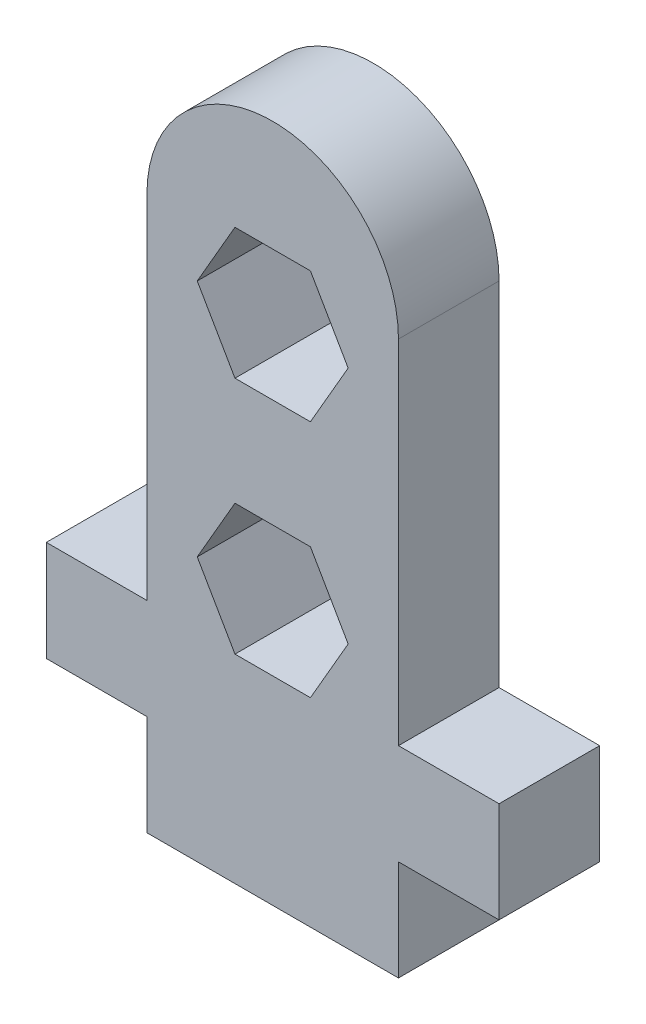
ISO-10303-21;
HEADER;
FILE_DESCRIPTION(('STEP AP214'),'2;1');
FILE_NAME('part.step','',(''),(''),'','','');
FILE_SCHEMA(('AUTOMOTIVE_DESIGN { 1 0 10303 214 1 1 1 1 }'));
ENDSEC;
DATA;
#1=APPLICATION_CONTEXT('core data for automotive mechanical design processes');
#2=APPLICATION_PROTOCOL_DEFINITION('international standard','automotive_design',2000,#1);
#3=PRODUCT_CONTEXT('',#1,'mechanical');
#4=PRODUCT('Part','Part','',(#3));
#5=PRODUCT_RELATED_PRODUCT_CATEGORY('part','',(#4));
#6=PRODUCT_DEFINITION_FORMATION('','',#4);
#7=PRODUCT_DEFINITION_CONTEXT('part definition',#1,'design');
#8=PRODUCT_DEFINITION('design','',#6,#7);
#9=PRODUCT_DEFINITION_SHAPE('','',#8);
#10=(LENGTH_UNIT() NAMED_UNIT(*) SI_UNIT(.MILLI.,.METRE.));
#11=(NAMED_UNIT(*) PLANE_ANGLE_UNIT() SI_UNIT($,.RADIAN.));
#12=(NAMED_UNIT(*) SI_UNIT($,.STERADIAN.) SOLID_ANGLE_UNIT());
#13=UNCERTAINTY_MEASURE_WITH_UNIT(LENGTH_MEASURE(1.E-05),#10,'distance_accuracy_value','');
#14=(GEOMETRIC_REPRESENTATION_CONTEXT(3) GLOBAL_UNCERTAINTY_ASSIGNED_CONTEXT((#13)) GLOBAL_UNIT_ASSIGNED_CONTEXT((#10,
#11,#12)) REPRESENTATION_CONTEXT('',''));
#15=CARTESIAN_POINT('',(0.,0.,0.));
#16=DIRECTION('',(0.,0.,1.));
#17=DIRECTION('',(1.,0.,0.));
#18=AXIS2_PLACEMENT_3D('',#15,#16,#17);
#19=CARTESIAN_POINT('',(5.,22.,4.));
#20=DIRECTION('',(0.,0.,1.));
#21=DIRECTION('',(1.,0.,0.));
#22=AXIS2_PLACEMENT_3D('',#19,#20,#21);
#23=PLANE('',#22);
#24=DIRECTION('',(-0.5,-0.866025403784438,0.));
#25=VECTOR('',#24,1.);
#26=CARTESIAN_POINT('',(3.5,22.5980762113533,4.));
#27=LINE('',#26,#25);
#28=CARTESIAN_POINT('',(3.5,22.5980762113533,4.));
#29=VERTEX_POINT('',#28);
#30=CARTESIAN_POINT('',(1.99999999999999,20.,4.));
#31=VERTEX_POINT('',#30);
#32=EDGE_CURVE('E247',#29,#31,#27,.T.);
#33=ORIENTED_EDGE('',*,*,#32,.F.);
#34=DIRECTION('',(-1.,0.,0.));
#35=VECTOR('',#34,1.);
#36=CARTESIAN_POINT('',(6.5,22.5980762113533,4.));
#37=LINE('',#36,#35);
#38=CARTESIAN_POINT('',(6.5,22.5980762113533,4.));
#39=VERTEX_POINT('',#38);
#40=EDGE_CURVE('E245',#39,#29,#37,.T.);
#41=ORIENTED_EDGE('',*,*,#40,.F.);
#42=DIRECTION('',(-0.5,0.866025403784438,0.));
#43=VECTOR('',#42,1.);
#44=CARTESIAN_POINT('',(8.00000000000001,20.,4.));
#45=LINE('',#44,#43);
#46=CARTESIAN_POINT('',(8.00000000000001,20.,4.));
#47=VERTEX_POINT('',#46);
#48=EDGE_CURVE('E257',#47,#39,#45,.T.);
#49=ORIENTED_EDGE('',*,*,#48,.F.);
#50=DIRECTION('',(0.499999999999999,0.866025403784439,0.));
#51=VECTOR('',#50,1.);
#52=CARTESIAN_POINT('',(6.50000000000001,17.4019237886467,4.));
#53=LINE('',#52,#51);
#54=CARTESIAN_POINT('',(6.50000000000001,17.4019237886467,4.));
#55=VERTEX_POINT('',#54);
#56=EDGE_CURVE('E254',#55,#47,#53,.T.);
#57=ORIENTED_EDGE('',*,*,#56,.F.);
#58=DIRECTION('',(1.,0.,0.));
#59=VECTOR('',#58,1.);
#60=CARTESIAN_POINT('',(3.5,17.4019237886467,4.));
#61=LINE('',#60,#59);
#62=CARTESIAN_POINT('',(3.5,17.4019237886467,4.));
#63=VERTEX_POINT('',#62);
#64=EDGE_CURVE('E252',#63,#55,#61,.T.);
#65=ORIENTED_EDGE('',*,*,#64,.F.);
#66=DIRECTION('',(0.5,-0.866025403784439,0.));
#67=VECTOR('',#66,1.);
#68=CARTESIAN_POINT('',(1.99999999999999,20.,4.));
#69=LINE('',#68,#67);
#70=EDGE_CURVE('E250',#31,#63,#69,.T.);
#71=ORIENTED_EDGE('',*,*,#70,.F.);
#72=EDGE_LOOP('',(#33,#41,#49,#57,#65,#71));
#73=FACE_BOUND('',#72,.T.);
#74=DIRECTION('',(0.,-1.,0.));
#75=VECTOR('',#74,1.);
#76=CARTESIAN_POINT('',(0.,0.,4.));
#77=LINE('',#76,#75);
#78=CARTESIAN_POINT('',(0.,4.,4.));
#79=VERTEX_POINT('',#78);
#80=CARTESIAN_POINT('',(0.,0.,4.));
#81=VERTEX_POINT('',#80);
#82=EDGE_CURVE('E290',#79,#81,#77,.T.);
#83=ORIENTED_EDGE('',*,*,#82,.T.);
#84=DIRECTION('',(1.,0.,0.));
#85=VECTOR('',#84,1.);
#86=CARTESIAN_POINT('',(0.,0.,4.));
#87=LINE('',#86,#85);
#88=CARTESIAN_POINT('',(10.,0.,4.));
#89=VERTEX_POINT('',#88);
#90=EDGE_CURVE('E293',#81,#89,#87,.T.);
#91=ORIENTED_EDGE('',*,*,#90,.T.);
#92=DIRECTION('',(0.,1.,0.));
#93=VECTOR('',#92,1.);
#94=CARTESIAN_POINT('',(10.,0.,4.));
#95=LINE('',#94,#93);
#96=CARTESIAN_POINT('',(10.,4.,4.));
#97=VERTEX_POINT('',#96);
#98=EDGE_CURVE('E296',#89,#97,#95,.T.);
#99=ORIENTED_EDGE('',*,*,#98,.T.);
#100=DIRECTION('',(1.,0.,0.));
#101=VECTOR('',#100,1.);
#102=CARTESIAN_POINT('',(10.,4.,4.));
#103=LINE('',#102,#101);
#104=CARTESIAN_POINT('',(14.,4.,4.));
#105=VERTEX_POINT('',#104);
#106=EDGE_CURVE('E298',#97,#105,#103,.T.);
#107=ORIENTED_EDGE('',*,*,#106,.T.);
#108=DIRECTION('',(0.,1.,0.));
#109=VECTOR('',#108,1.);
#110=CARTESIAN_POINT('',(14.,4.,4.));
#111=LINE('',#110,#109);
#112=CARTESIAN_POINT('',(14.,8.,4.));
#113=VERTEX_POINT('',#112);
#114=EDGE_CURVE('E300',#105,#113,#111,.T.);
#115=ORIENTED_EDGE('',*,*,#114,.T.);
#116=DIRECTION('',(-1.,0.,0.));
#117=VECTOR('',#116,1.);
#118=CARTESIAN_POINT('',(14.,8.,4.));
#119=LINE('',#118,#117);
#120=CARTESIAN_POINT('',(10.,8.,4.));
#121=VERTEX_POINT('',#120);
#122=EDGE_CURVE('E302',#113,#121,#119,.T.);
#123=ORIENTED_EDGE('',*,*,#122,.T.);
#124=DIRECTION('',(0.,1.,0.));
#125=VECTOR('',#124,1.);
#126=CARTESIAN_POINT('',(10.,8.,4.));
#127=LINE('',#126,#125);
#128=CARTESIAN_POINT('',(10.,22.,4.));
#129=VERTEX_POINT('',#128);
#130=EDGE_CURVE('E304',#121,#129,#127,.T.);
#131=ORIENTED_EDGE('',*,*,#130,.T.);
#132=CARTESIAN_POINT('',(5.,22.,4.));
#133=DIRECTION('',(0.,0.,1.));
#134=DIRECTION('',(1.,0.,0.));
#135=AXIS2_PLACEMENT_3D('',#132,#133,#134);
#136=CIRCLE('',#135,5.);
#137=CARTESIAN_POINT('',(0.,22.,4.));
#138=VERTEX_POINT('',#137);
#139=EDGE_CURVE('E306',#129,#138,#136,.T.);
#140=ORIENTED_EDGE('',*,*,#139,.T.);
#141=DIRECTION('',(0.,-1.,0.));
#142=VECTOR('',#141,1.);
#143=CARTESIAN_POINT('',(0.,8.,4.));
#144=LINE('',#143,#142);
#145=CARTESIAN_POINT('',(0.,8.,4.));
#146=VERTEX_POINT('',#145);
#147=EDGE_CURVE('E308',#138,#146,#144,.T.);
#148=ORIENTED_EDGE('',*,*,#147,.T.);
#149=DIRECTION('',(-1.,0.,0.));
#150=VECTOR('',#149,1.);
#151=CARTESIAN_POINT('',(-4.,8.,4.));
#152=LINE('',#151,#150);
#153=CARTESIAN_POINT('',(-4.,8.,4.));
#154=VERTEX_POINT('',#153);
#155=EDGE_CURVE('E310',#146,#154,#152,.T.);
#156=ORIENTED_EDGE('',*,*,#155,.T.);
#157=DIRECTION('',(0.,-1.,0.));
#158=VECTOR('',#157,1.);
#159=CARTESIAN_POINT('',(-4.,4.,4.));
#160=LINE('',#159,#158);
#161=CARTESIAN_POINT('',(-4.,4.,4.));
#162=VERTEX_POINT('',#161);
#163=EDGE_CURVE('E312',#154,#162,#160,.T.);
#164=ORIENTED_EDGE('',*,*,#163,.T.);
#165=DIRECTION('',(1.,0.,0.));
#166=VECTOR('',#165,1.);
#167=CARTESIAN_POINT('',(0.,4.,4.));
#168=LINE('',#167,#166);
#169=EDGE_CURVE('E314',#162,#79,#168,.T.);
#170=ORIENTED_EDGE('',*,*,#169,.T.);
#171=EDGE_LOOP('',(#83,#91,#99,#107,#115,#123,#131,#140,#148,#156,#164,#170));
#172=FACE_BOUND('',#171,.T.);
#173=DIRECTION('',(-0.5,-0.866025403784438,0.));
#174=VECTOR('',#173,1.);
#175=CARTESIAN_POINT('',(3.5,13.0980762113533,4.));
#176=LINE('',#175,#174);
#177=CARTESIAN_POINT('',(3.5,13.0980762113533,4.));
#178=VERTEX_POINT('',#177);
#179=CARTESIAN_POINT('',(1.99999999999999,10.5,4.));
#180=VERTEX_POINT('',#179);
#181=EDGE_CURVE('E202',#178,#180,#176,.T.);
#182=ORIENTED_EDGE('',*,*,#181,.F.);
#183=DIRECTION('',(-1.,0.,0.));
#184=VECTOR('',#183,1.);
#185=CARTESIAN_POINT('',(6.5,13.0980762113533,4.));
#186=LINE('',#185,#184);
#187=CARTESIAN_POINT('',(6.5,13.0980762113533,4.));
#188=VERTEX_POINT('',#187);
#189=EDGE_CURVE('E194',#188,#178,#186,.T.);
#190=ORIENTED_EDGE('',*,*,#189,.F.);
#191=DIRECTION('',(-0.5,0.866025403784439,0.));
#192=VECTOR('',#191,1.);
#193=CARTESIAN_POINT('',(8.00000000000001,10.5,4.));
#194=LINE('',#193,#192);
#195=CARTESIAN_POINT('',(8.00000000000001,10.5,4.));
#196=VERTEX_POINT('',#195);
#197=EDGE_CURVE('E223',#196,#188,#194,.T.);
#198=ORIENTED_EDGE('',*,*,#197,.F.);
#199=DIRECTION('',(0.5,0.866025403784439,0.));
#200=VECTOR('',#199,1.);
#201=CARTESIAN_POINT('',(6.5,7.90192378864668,4.));
#202=LINE('',#201,#200);
#203=CARTESIAN_POINT('',(6.5,7.90192378864668,4.));
#204=VERTEX_POINT('',#203);
#205=EDGE_CURVE('E221',#204,#196,#202,.T.);
#206=ORIENTED_EDGE('',*,*,#205,.F.);
#207=DIRECTION('',(1.,0.,0.));
#208=VECTOR('',#207,1.);
#209=CARTESIAN_POINT('',(3.5,7.90192378864668,4.));
#210=LINE('',#209,#208);
#211=CARTESIAN_POINT('',(3.5,7.90192378864668,4.));
#212=VERTEX_POINT('',#211);
#213=EDGE_CURVE('E217',#212,#204,#210,.T.);
#214=ORIENTED_EDGE('',*,*,#213,.F.);
#215=DIRECTION('',(0.5,-0.866025403784439,0.));
#216=VECTOR('',#215,1.);
#217=CARTESIAN_POINT('',(1.99999999999999,10.5,4.));
#218=LINE('',#217,#216);
#219=EDGE_CURVE('E215',#180,#212,#218,.T.);
#220=ORIENTED_EDGE('',*,*,#219,.F.);
#221=EDGE_LOOP('',(#182,#190,#198,#206,#214,#220));
#222=FACE_BOUND('',#221,.T.);
#223=ADVANCED_FACE('F33',(#73,#172,#222),#23,.T.);
#224=CARTESIAN_POINT('',(5.,22.,0.));
#225=DIRECTION('',(0.,0.,1.));
#226=DIRECTION('',(1.,0.,0.));
#227=AXIS2_PLACEMENT_3D('',#224,#225,#226);
#228=PLANE('',#227);
#229=DIRECTION('',(-1.,0.,0.));
#230=VECTOR('',#229,1.);
#231=CARTESIAN_POINT('',(6.5,22.5980762113533,0.));
#232=LINE('',#231,#230);
#233=CARTESIAN_POINT('',(6.5,22.5980762113533,0.));
#234=VERTEX_POINT('',#233);
#235=CARTESIAN_POINT('',(3.5,22.5980762113533,0.));
#236=VERTEX_POINT('',#235);
#237=EDGE_CURVE('E210',#234,#236,#232,.T.);
#238=ORIENTED_EDGE('',*,*,#237,.T.);
#239=DIRECTION('',(-0.5,-0.866025403784438,0.));
#240=VECTOR('',#239,1.);
#241=CARTESIAN_POINT('',(3.5,22.5980762113533,0.));
#242=LINE('',#241,#240);
#243=CARTESIAN_POINT('',(1.99999999999999,20.,0.));
#244=VERTEX_POINT('',#243);
#245=EDGE_CURVE('E262',#236,#244,#242,.T.);
#246=ORIENTED_EDGE('',*,*,#245,.T.);
#247=DIRECTION('',(0.5,-0.866025403784439,0.));
#248=VECTOR('',#247,1.);
#249=CARTESIAN_POINT('',(1.99999999999999,20.,0.));
#250=LINE('',#249,#248);
#251=CARTESIAN_POINT('',(3.5,17.4019237886467,0.));
#252=VERTEX_POINT('',#251);
#253=EDGE_CURVE('E265',#244,#252,#250,.T.);
#254=ORIENTED_EDGE('',*,*,#253,.T.);
#255=DIRECTION('',(1.,0.,0.));
#256=VECTOR('',#255,1.);
#257=CARTESIAN_POINT('',(3.5,17.4019237886467,0.));
#258=LINE('',#257,#256);
#259=CARTESIAN_POINT('',(6.50000000000001,17.4019237886467,0.));
#260=VERTEX_POINT('',#259);
#261=EDGE_CURVE('E268',#252,#260,#258,.T.);
#262=ORIENTED_EDGE('',*,*,#261,.T.);
#263=DIRECTION('',(0.499999999999999,0.866025403784439,0.));
#264=VECTOR('',#263,1.);
#265=CARTESIAN_POINT('',(6.50000000000001,17.4019237886467,0.));
#266=LINE('',#265,#264);
#267=CARTESIAN_POINT('',(8.00000000000001,20.,0.));
#268=VERTEX_POINT('',#267);
#269=EDGE_CURVE('E271',#260,#268,#266,.T.);
#270=ORIENTED_EDGE('',*,*,#269,.T.);
#271=DIRECTION('',(-0.5,0.866025403784438,0.));
#272=VECTOR('',#271,1.);
#273=CARTESIAN_POINT('',(8.00000000000001,20.,0.));
#274=LINE('',#273,#272);
#275=EDGE_CURVE('E248',#268,#234,#274,.T.);
#276=ORIENTED_EDGE('',*,*,#275,.T.);
#277=EDGE_LOOP('',(#238,#246,#254,#262,#270,#276));
#278=FACE_BOUND('',#277,.T.);
#279=DIRECTION('',(0.,-1.,0.));
#280=VECTOR('',#279,1.);
#281=CARTESIAN_POINT('',(0.,0.,0.));
#282=LINE('',#281,#280);
#283=CARTESIAN_POINT('',(0.,4.,0.));
#284=VERTEX_POINT('',#283);
#285=CARTESIAN_POINT('',(0.,0.,0.));
#286=VERTEX_POINT('',#285);
#287=EDGE_CURVE('E289',#284,#286,#282,.T.);
#288=ORIENTED_EDGE('',*,*,#287,.F.);
#289=DIRECTION('',(1.,0.,0.));
#290=VECTOR('',#289,1.);
#291=CARTESIAN_POINT('',(0.,4.,0.));
#292=LINE('',#291,#290);
#293=CARTESIAN_POINT('',(-4.,4.,0.));
#294=VERTEX_POINT('',#293);
#295=EDGE_CURVE('E294',#294,#284,#292,.T.);
#296=ORIENTED_EDGE('',*,*,#295,.F.);
#297=DIRECTION('',(0.,-1.,0.));
#298=VECTOR('',#297,1.);
#299=CARTESIAN_POINT('',(-4.,4.,0.));
#300=LINE('',#299,#298);
#301=CARTESIAN_POINT('',(-4.,8.,0.));
#302=VERTEX_POINT('',#301);
#303=EDGE_CURVE('E337',#302,#294,#300,.T.);
#304=ORIENTED_EDGE('',*,*,#303,.F.);
#305=DIRECTION('',(-1.,0.,0.));
#306=VECTOR('',#305,1.);
#307=CARTESIAN_POINT('',(-4.,8.,0.));
#308=LINE('',#307,#306);
#309=CARTESIAN_POINT('',(0.,8.,0.));
#310=VERTEX_POINT('',#309);
#311=EDGE_CURVE('E335',#310,#302,#308,.T.);
#312=ORIENTED_EDGE('',*,*,#311,.F.);
#313=DIRECTION('',(0.,-1.,0.));
#314=VECTOR('',#313,1.);
#315=CARTESIAN_POINT('',(0.,8.,0.));
#316=LINE('',#315,#314);
#317=CARTESIAN_POINT('',(0.,22.,0.));
#318=VERTEX_POINT('',#317);
#319=EDGE_CURVE('E333',#318,#310,#316,.T.);
#320=ORIENTED_EDGE('',*,*,#319,.F.);
#321=CARTESIAN_POINT('',(5.,22.,0.));
#322=DIRECTION('',(0.,0.,1.));
#323=DIRECTION('',(1.,0.,0.));
#324=AXIS2_PLACEMENT_3D('',#321,#322,#323);
#325=CIRCLE('',#324,5.);
#326=CARTESIAN_POINT('',(10.,22.,0.));
#327=VERTEX_POINT('',#326);
#328=EDGE_CURVE('E331',#327,#318,#325,.T.);
#329=ORIENTED_EDGE('',*,*,#328,.F.);
#330=DIRECTION('',(0.,1.,0.));
#331=VECTOR('',#330,1.);
#332=CARTESIAN_POINT('',(10.,8.,0.));
#333=LINE('',#332,#331);
#334=CARTESIAN_POINT('',(10.,8.,0.));
#335=VERTEX_POINT('',#334);
#336=EDGE_CURVE('E329',#335,#327,#333,.T.);
#337=ORIENTED_EDGE('',*,*,#336,.F.);
#338=DIRECTION('',(-1.,0.,0.));
#339=VECTOR('',#338,1.);
#340=CARTESIAN_POINT('',(14.,8.,0.));
#341=LINE('',#340,#339);
#342=CARTESIAN_POINT('',(14.,8.,0.));
#343=VERTEX_POINT('',#342);
#344=EDGE_CURVE('E327',#343,#335,#341,.T.);
#345=ORIENTED_EDGE('',*,*,#344,.F.);
#346=DIRECTION('',(0.,1.,0.));
#347=VECTOR('',#346,1.);
#348=CARTESIAN_POINT('',(14.,4.,0.));
#349=LINE('',#348,#347);
#350=CARTESIAN_POINT('',(14.,4.,0.));
#351=VERTEX_POINT('',#350);
#352=EDGE_CURVE('E325',#351,#343,#349,.T.);
#353=ORIENTED_EDGE('',*,*,#352,.F.);
#354=DIRECTION('',(1.,0.,0.));
#355=VECTOR('',#354,1.);
#356=CARTESIAN_POINT('',(10.,4.,0.));
#357=LINE('',#356,#355);
#358=CARTESIAN_POINT('',(10.,4.,0.));
#359=VERTEX_POINT('',#358);
#360=EDGE_CURVE('E323',#359,#351,#357,.T.);
#361=ORIENTED_EDGE('',*,*,#360,.F.);
#362=DIRECTION('',(0.,1.,0.));
#363=VECTOR('',#362,1.);
#364=CARTESIAN_POINT('',(10.,0.,0.));
#365=LINE('',#364,#363);
#366=CARTESIAN_POINT('',(10.,0.,0.));
#367=VERTEX_POINT('',#366);
#368=EDGE_CURVE('E321',#367,#359,#365,.T.);
#369=ORIENTED_EDGE('',*,*,#368,.F.);
#370=DIRECTION('',(1.,0.,0.));
#371=VECTOR('',#370,1.);
#372=CARTESIAN_POINT('',(0.,0.,0.));
#373=LINE('',#372,#371);
#374=EDGE_CURVE('E319',#286,#367,#373,.T.);
#375=ORIENTED_EDGE('',*,*,#374,.F.);
#376=EDGE_LOOP('',(#288,#296,#304,#312,#320,#329,#337,#345,#353,#361,#369,#375));
#377=FACE_BOUND('',#376,.T.);
#378=DIRECTION('',(-1.,0.,0.));
#379=VECTOR('',#378,1.);
#380=CARTESIAN_POINT('',(6.5,13.0980762113533,0.));
#381=LINE('',#380,#379);
#382=CARTESIAN_POINT('',(6.5,13.0980762113533,0.));
#383=VERTEX_POINT('',#382);
#384=CARTESIAN_POINT('',(3.5,13.0980762113533,0.));
#385=VERTEX_POINT('',#384);
#386=EDGE_CURVE('E56',#383,#385,#381,.T.);
#387=ORIENTED_EDGE('',*,*,#386,.T.);
#388=DIRECTION('',(-0.5,-0.866025403784438,0.));
#389=VECTOR('',#388,1.);
#390=CARTESIAN_POINT('',(3.5,13.0980762113533,0.));
#391=LINE('',#390,#389);
#392=CARTESIAN_POINT('',(1.99999999999999,10.5,0.));
#393=VERTEX_POINT('',#392);
#394=EDGE_CURVE('E209',#385,#393,#391,.T.);
#395=ORIENTED_EDGE('',*,*,#394,.T.);
#396=DIRECTION('',(0.5,-0.866025403784439,0.));
#397=VECTOR('',#396,1.);
#398=CARTESIAN_POINT('',(1.99999999999999,10.5,0.));
#399=LINE('',#398,#397);
#400=CARTESIAN_POINT('',(3.5,7.90192378864668,0.));
#401=VERTEX_POINT('',#400);
#402=EDGE_CURVE('E227',#393,#401,#399,.T.);
#403=ORIENTED_EDGE('',*,*,#402,.T.);
#404=DIRECTION('',(1.,0.,0.));
#405=VECTOR('',#404,1.);
#406=CARTESIAN_POINT('',(3.5,7.90192378864668,0.));
#407=LINE('',#406,#405);
#408=CARTESIAN_POINT('',(6.5,7.90192378864668,0.));
#409=VERTEX_POINT('',#408);
#410=EDGE_CURVE('E230',#401,#409,#407,.T.);
#411=ORIENTED_EDGE('',*,*,#410,.T.);
#412=DIRECTION('',(0.5,0.866025403784439,0.));
#413=VECTOR('',#412,1.);
#414=CARTESIAN_POINT('',(6.5,7.90192378864668,0.));
#415=LINE('',#414,#413);
#416=CARTESIAN_POINT('',(8.00000000000001,10.5,0.));
#417=VERTEX_POINT('',#416);
#418=EDGE_CURVE('E233',#409,#417,#415,.T.);
#419=ORIENTED_EDGE('',*,*,#418,.T.);
#420=DIRECTION('',(-0.5,0.866025403784439,0.));
#421=VECTOR('',#420,1.);
#422=CARTESIAN_POINT('',(8.00000000000001,10.5,0.));
#423=LINE('',#422,#421);
#424=EDGE_CURVE('E203',#417,#383,#423,.T.);
#425=ORIENTED_EDGE('',*,*,#424,.T.);
#426=EDGE_LOOP('',(#387,#395,#403,#411,#419,#425));
#427=FACE_BOUND('',#426,.T.);
#428=ADVANCED_FACE('F379',(#278,#377,#427),#228,.F.);
#429=CARTESIAN_POINT('',(0.,0.,4.));
#430=DIRECTION('',(1.,0.,0.));
#431=DIRECTION('',(0.,0.,-1.));
#432=AXIS2_PLACEMENT_3D('',#429,#430,#431);
#433=PLANE('',#432);
#434=ORIENTED_EDGE('',*,*,#287,.T.);
#435=DIRECTION('',(0.,0.,-1.));
#436=VECTOR('',#435,1.);
#437=CARTESIAN_POINT('',(0.,0.,4.));
#438=LINE('',#437,#436);
#439=EDGE_CURVE('E11',#81,#286,#438,.T.);
#440=ORIENTED_EDGE('',*,*,#439,.F.);
#441=ORIENTED_EDGE('',*,*,#82,.F.);
#442=DIRECTION('',(0.,0.,-1.));
#443=VECTOR('',#442,1.);
#444=CARTESIAN_POINT('',(0.,4.,4.));
#445=LINE('',#444,#443);
#446=EDGE_CURVE('E316',#79,#284,#445,.T.);
#447=ORIENTED_EDGE('',*,*,#446,.T.);
#448=EDGE_LOOP('',(#434,#440,#441,#447));
#449=FACE_BOUND('',#448,.T.);
#450=ADVANCED_FACE('F35',(#449),#433,.F.);
#451=CARTESIAN_POINT('',(0.,0.,4.));
#452=DIRECTION('',(0.,1.,0.));
#453=DIRECTION('',(0.,0.,1.));
#454=AXIS2_PLACEMENT_3D('',#451,#452,#453);
#455=PLANE('',#454);
#456=ORIENTED_EDGE('',*,*,#374,.T.);
#457=DIRECTION('',(0.,0.,-1.));
#458=VECTOR('',#457,1.);
#459=CARTESIAN_POINT('',(10.,0.,4.));
#460=LINE('',#459,#458);
#461=EDGE_CURVE('E41',#89,#367,#460,.T.);
#462=ORIENTED_EDGE('',*,*,#461,.F.);
#463=ORIENTED_EDGE('',*,*,#90,.F.);
#464=ORIENTED_EDGE('',*,*,#439,.T.);
#465=EDGE_LOOP('',(#456,#462,#463,#464));
#466=FACE_BOUND('',#465,.T.);
#467=ADVANCED_FACE('F396',(#466),#455,.F.);
#468=CARTESIAN_POINT('',(10.,0.,4.));
#469=DIRECTION('',(-1.,0.,0.));
#470=DIRECTION('',(0.,0.,1.));
#471=AXIS2_PLACEMENT_3D('',#468,#469,#470);
#472=PLANE('',#471);
#473=ORIENTED_EDGE('',*,*,#368,.T.);
#474=DIRECTION('',(0.,0.,-1.));
#475=VECTOR('',#474,1.);
#476=CARTESIAN_POINT('',(10.,4.,4.));
#477=LINE('',#476,#475);
#478=EDGE_CURVE('E366',#97,#359,#477,.T.);
#479=ORIENTED_EDGE('',*,*,#478,.F.);
#480=ORIENTED_EDGE('',*,*,#98,.F.);
#481=ORIENTED_EDGE('',*,*,#461,.T.);
#482=EDGE_LOOP('',(#473,#479,#480,#481));
#483=FACE_BOUND('',#482,.T.);
#484=ADVANCED_FACE('F373',(#483),#472,.F.);
#485=CARTESIAN_POINT('',(10.,4.,4.));
#486=DIRECTION('',(0.,1.,0.));
#487=DIRECTION('',(-1.,0.,0.));
#488=AXIS2_PLACEMENT_3D('',#485,#486,#487);
#489=PLANE('',#488);
#490=ORIENTED_EDGE('',*,*,#360,.T.);
#491=DIRECTION('',(0.,0.,-1.));
#492=VECTOR('',#491,1.);
#493=CARTESIAN_POINT('',(14.,4.,4.));
#494=LINE('',#493,#492);
#495=EDGE_CURVE('E363',#105,#351,#494,.T.);
#496=ORIENTED_EDGE('',*,*,#495,.F.);
#497=ORIENTED_EDGE('',*,*,#106,.F.);
#498=ORIENTED_EDGE('',*,*,#478,.T.);
#499=EDGE_LOOP('',(#490,#496,#497,#498));
#500=FACE_BOUND('',#499,.T.);
#501=ADVANCED_FACE('F385',(#500),#489,.F.);
#502=CARTESIAN_POINT('',(14.,4.,4.));
#503=DIRECTION('',(-1.,0.,0.));
#504=DIRECTION('',(0.,0.,1.));
#505=AXIS2_PLACEMENT_3D('',#502,#503,#504);
#506=PLANE('',#505);
#507=ORIENTED_EDGE('',*,*,#352,.T.);
#508=DIRECTION('',(0.,0.,-1.));
#509=VECTOR('',#508,1.);
#510=CARTESIAN_POINT('',(14.,8.,4.));
#511=LINE('',#510,#509);
#512=EDGE_CURVE('E360',#113,#343,#511,.T.);
#513=ORIENTED_EDGE('',*,*,#512,.F.);
#514=ORIENTED_EDGE('',*,*,#114,.F.);
#515=ORIENTED_EDGE('',*,*,#495,.T.);
#516=EDGE_LOOP('',(#507,#513,#514,#515));
#517=FACE_BOUND('',#516,.T.);
#518=ADVANCED_FACE('F389',(#517),#506,.F.);
#519=CARTESIAN_POINT('',(14.,8.,4.));
#520=DIRECTION('',(0.,-1.,0.));
#521=DIRECTION('',(0.,0.,-1.));
#522=AXIS2_PLACEMENT_3D('',#519,#520,#521);
#523=PLANE('',#522);
#524=ORIENTED_EDGE('',*,*,#344,.T.);
#525=DIRECTION('',(0.,0.,-1.));
#526=VECTOR('',#525,1.);
#527=CARTESIAN_POINT('',(10.,8.,4.));
#528=LINE('',#527,#526);
#529=EDGE_CURVE('E357',#121,#335,#528,.T.);
#530=ORIENTED_EDGE('',*,*,#529,.F.);
#531=ORIENTED_EDGE('',*,*,#122,.F.);
#532=ORIENTED_EDGE('',*,*,#512,.T.);
#533=EDGE_LOOP('',(#524,#530,#531,#532));
#534=FACE_BOUND('',#533,.T.);
#535=ADVANCED_FACE('F429',(#534),#523,.F.);
#536=CARTESIAN_POINT('',(10.,8.,4.));
#537=DIRECTION('',(-1.,0.,0.));
#538=DIRECTION('',(0.,0.,1.));
#539=AXIS2_PLACEMENT_3D('',#536,#537,#538);
#540=PLANE('',#539);
#541=ORIENTED_EDGE('',*,*,#336,.T.);
#542=DIRECTION('',(0.,0.,-1.));
#543=VECTOR('',#542,1.);
#544=CARTESIAN_POINT('',(10.,22.,4.));
#545=LINE('',#544,#543);
#546=EDGE_CURVE('E354',#129,#327,#545,.T.);
#547=ORIENTED_EDGE('',*,*,#546,.F.);
#548=ORIENTED_EDGE('',*,*,#130,.F.);
#549=ORIENTED_EDGE('',*,*,#529,.T.);
#550=EDGE_LOOP('',(#541,#547,#548,#549));
#551=FACE_BOUND('',#550,.T.);
#552=ADVANCED_FACE('F427',(#551),#540,.F.);
#553=CARTESIAN_POINT('',(5.,22.,4.));
#554=DIRECTION('',(0.,0.,-1.));
#555=DIRECTION('',(-1.,0.,0.));
#556=AXIS2_PLACEMENT_3D('',#553,#554,#555);
#557=CYLINDRICAL_SURFACE('',#556,5.);
#558=ORIENTED_EDGE('',*,*,#328,.T.);
#559=DIRECTION('',(0.,0.,-1.));
#560=VECTOR('',#559,1.);
#561=CARTESIAN_POINT('',(0.,22.,4.));
#562=LINE('',#561,#560);
#563=EDGE_CURVE('E351',#138,#318,#562,.T.);
#564=ORIENTED_EDGE('',*,*,#563,.F.);
#565=ORIENTED_EDGE('',*,*,#139,.F.);
#566=ORIENTED_EDGE('',*,*,#546,.T.);
#567=EDGE_LOOP('',(#558,#564,#565,#566));
#568=FACE_BOUND('',#567,.T.);
#569=ADVANCED_FACE('F423',(#568),#557,.T.);
#570=CARTESIAN_POINT('',(0.,8.,4.));
#571=DIRECTION('',(1.,0.,0.));
#572=DIRECTION('',(0.,0.,-1.));
#573=AXIS2_PLACEMENT_3D('',#570,#571,#572);
#574=PLANE('',#573);
#575=ORIENTED_EDGE('',*,*,#319,.T.);
#576=DIRECTION('',(0.,0.,-1.));
#577=VECTOR('',#576,1.);
#578=CARTESIAN_POINT('',(0.,8.,4.));
#579=LINE('',#578,#577);
#580=EDGE_CURVE('E348',#146,#310,#579,.T.);
#581=ORIENTED_EDGE('',*,*,#580,.F.);
#582=ORIENTED_EDGE('',*,*,#147,.F.);
#583=ORIENTED_EDGE('',*,*,#563,.T.);
#584=EDGE_LOOP('',(#575,#581,#582,#583));
#585=FACE_BOUND('',#584,.T.);
#586=ADVANCED_FACE('F418',(#585),#574,.F.);
#587=CARTESIAN_POINT('',(-4.,8.,4.));
#588=DIRECTION('',(0.,-1.,0.));
#589=DIRECTION('',(1.,0.,0.));
#590=AXIS2_PLACEMENT_3D('',#587,#588,#589);
#591=PLANE('',#590);
#592=ORIENTED_EDGE('',*,*,#311,.T.);
#593=DIRECTION('',(0.,0.,-1.));
#594=VECTOR('',#593,1.);
#595=CARTESIAN_POINT('',(-4.,8.,4.));
#596=LINE('',#595,#594);
#597=EDGE_CURVE('E345',#154,#302,#596,.T.);
#598=ORIENTED_EDGE('',*,*,#597,.F.);
#599=ORIENTED_EDGE('',*,*,#155,.F.);
#600=ORIENTED_EDGE('',*,*,#580,.T.);
#601=EDGE_LOOP('',(#592,#598,#599,#600));
#602=FACE_BOUND('',#601,.T.);
#603=ADVANCED_FACE('F412',(#602),#591,.F.);
#604=CARTESIAN_POINT('',(-4.,4.,4.));
#605=DIRECTION('',(1.,0.,0.));
#606=DIRECTION('',(0.,0.,-1.));
#607=AXIS2_PLACEMENT_3D('',#604,#605,#606);
#608=PLANE('',#607);
#609=ORIENTED_EDGE('',*,*,#303,.T.);
#610=DIRECTION('',(0.,0.,-1.));
#611=VECTOR('',#610,1.);
#612=CARTESIAN_POINT('',(-4.,4.,4.));
#613=LINE('',#612,#611);
#614=EDGE_CURVE('E342',#162,#294,#613,.T.);
#615=ORIENTED_EDGE('',*,*,#614,.F.);
#616=ORIENTED_EDGE('',*,*,#163,.F.);
#617=ORIENTED_EDGE('',*,*,#597,.T.);
#618=EDGE_LOOP('',(#609,#615,#616,#617));
#619=FACE_BOUND('',#618,.T.);
#620=ADVANCED_FACE('F408',(#619),#608,.F.);
#621=CARTESIAN_POINT('',(0.,4.,4.));
#622=DIRECTION('',(0.,1.,0.));
#623=DIRECTION('',(-1.,0.,0.));
#624=AXIS2_PLACEMENT_3D('',#621,#622,#623);
#625=PLANE('',#624);
#626=ORIENTED_EDGE('',*,*,#295,.T.);
#627=ORIENTED_EDGE('',*,*,#446,.F.);
#628=ORIENTED_EDGE('',*,*,#169,.F.);
#629=ORIENTED_EDGE('',*,*,#614,.T.);
#630=EDGE_LOOP('',(#626,#627,#628,#629));
#631=FACE_BOUND('',#630,.T.);
#632=ADVANCED_FACE('F403',(#631),#625,.F.);
#633=CARTESIAN_POINT('',(6.5,22.5980762113533,4.));
#634=DIRECTION('',(0.,-1.,0.));
#635=DIRECTION('',(0.,0.,-1.));
#636=AXIS2_PLACEMENT_3D('',#633,#634,#635);
#637=PLANE('',#636);
#638=ORIENTED_EDGE('',*,*,#237,.F.);
#639=DIRECTION('',(0.,0.,-1.));
#640=VECTOR('',#639,1.);
#641=CARTESIAN_POINT('',(6.5,22.5980762113533,4.));
#642=LINE('',#641,#640);
#643=EDGE_CURVE('E259',#39,#234,#642,.T.);
#644=ORIENTED_EDGE('',*,*,#643,.F.);
#645=ORIENTED_EDGE('',*,*,#40,.T.);
#646=DIRECTION('',(0.,0.,-1.));
#647=VECTOR('',#646,1.);
#648=CARTESIAN_POINT('',(3.5,22.5980762113533,4.));
#649=LINE('',#648,#647);
#650=EDGE_CURVE('E286',#29,#236,#649,.T.);
#651=ORIENTED_EDGE('',*,*,#650,.T.);
#652=EDGE_LOOP('',(#638,#644,#645,#651));
#653=FACE_BOUND('',#652,.T.);
#654=ADVANCED_FACE('F448',(#653),#637,.T.);
#655=CARTESIAN_POINT('',(3.5,22.5980762113533,4.));
#656=DIRECTION('',(0.866025403784439,-0.5,0.));
#657=DIRECTION('',(0.5,0.866025403784439,0.));
#658=AXIS2_PLACEMENT_3D('',#655,#656,#657);
#659=PLANE('',#658);
#660=ORIENTED_EDGE('',*,*,#245,.F.);
#661=ORIENTED_EDGE('',*,*,#650,.F.);
#662=ORIENTED_EDGE('',*,*,#32,.T.);
#663=DIRECTION('',(0.,0.,-1.));
#664=VECTOR('',#663,1.);
#665=CARTESIAN_POINT('',(1.99999999999999,20.,4.));
#666=LINE('',#665,#664);
#667=EDGE_CURVE('E284',#31,#244,#666,.T.);
#668=ORIENTED_EDGE('',*,*,#667,.T.);
#669=EDGE_LOOP('',(#660,#661,#662,#668));
#670=FACE_BOUND('',#669,.T.);
#671=ADVANCED_FACE('F486',(#670),#659,.T.);
#672=CARTESIAN_POINT('',(1.99999999999999,20.,4.));
#673=DIRECTION('',(0.866025403784439,0.5,0.));
#674=DIRECTION('',(-0.5,0.866025403784439,0.));
#675=AXIS2_PLACEMENT_3D('',#672,#673,#674);
#676=PLANE('',#675);
#677=ORIENTED_EDGE('',*,*,#253,.F.);
#678=ORIENTED_EDGE('',*,*,#667,.F.);
#679=ORIENTED_EDGE('',*,*,#70,.T.);
#680=DIRECTION('',(0.,0.,-1.));
#681=VECTOR('',#680,1.);
#682=CARTESIAN_POINT('',(3.5,17.4019237886467,4.));
#683=LINE('',#682,#681);
#684=EDGE_CURVE('E282',#63,#252,#683,.T.);
#685=ORIENTED_EDGE('',*,*,#684,.T.);
#686=EDGE_LOOP('',(#677,#678,#679,#685));
#687=FACE_BOUND('',#686,.T.);
#688=ADVANCED_FACE('F493',(#687),#676,.T.);
#689=CARTESIAN_POINT('',(3.5,17.4019237886467,4.));
#690=DIRECTION('',(0.,1.,0.));
#691=DIRECTION('',(-1.,0.,0.));
#692=AXIS2_PLACEMENT_3D('',#689,#690,#691);
#693=PLANE('',#692);
#694=ORIENTED_EDGE('',*,*,#261,.F.);
#695=ORIENTED_EDGE('',*,*,#684,.F.);
#696=ORIENTED_EDGE('',*,*,#64,.T.);
#697=DIRECTION('',(0.,0.,-1.));
#698=VECTOR('',#697,1.);
#699=CARTESIAN_POINT('',(6.50000000000001,17.4019237886467,4.));
#700=LINE('',#699,#698);
#701=EDGE_CURVE('E280',#55,#260,#700,.T.);
#702=ORIENTED_EDGE('',*,*,#701,.T.);
#703=EDGE_LOOP('',(#694,#695,#696,#702));
#704=FACE_BOUND('',#703,.T.);
#705=ADVANCED_FACE('F500',(#704),#693,.T.);
#706=CARTESIAN_POINT('',(6.50000000000001,17.4019237886467,4.));
#707=DIRECTION('',(-0.866025403784439,0.499999999999999,0.));
#708=DIRECTION('',(-0.499999999999999,-0.866025403784439,0.));
#709=AXIS2_PLACEMENT_3D('',#706,#707,#708);
#710=PLANE('',#709);
#711=ORIENTED_EDGE('',*,*,#269,.F.);
#712=ORIENTED_EDGE('',*,*,#701,.F.);
#713=ORIENTED_EDGE('',*,*,#56,.T.);
#714=DIRECTION('',(0.,0.,-1.));
#715=VECTOR('',#714,1.);
#716=CARTESIAN_POINT('',(8.00000000000001,20.,4.));
#717=LINE('',#716,#715);
#718=EDGE_CURVE('E278',#47,#268,#717,.T.);
#719=ORIENTED_EDGE('',*,*,#718,.T.);
#720=EDGE_LOOP('',(#711,#712,#713,#719));
#721=FACE_BOUND('',#720,.T.);
#722=ADVANCED_FACE('F508',(#721),#710,.T.);
#723=CARTESIAN_POINT('',(8.00000000000001,20.,4.));
#724=DIRECTION('',(-0.866025403784438,-0.5,0.));
#725=DIRECTION('',(0.5,-0.866025403784438,0.));
#726=AXIS2_PLACEMENT_3D('',#723,#724,#725);
#727=PLANE('',#726);
#728=ORIENTED_EDGE('',*,*,#275,.F.);
#729=ORIENTED_EDGE('',*,*,#718,.F.);
#730=ORIENTED_EDGE('',*,*,#48,.T.);
#731=ORIENTED_EDGE('',*,*,#643,.T.);
#732=EDGE_LOOP('',(#728,#729,#730,#731));
#733=FACE_BOUND('',#732,.T.);
#734=ADVANCED_FACE('F516',(#733),#727,.T.);
#735=CARTESIAN_POINT('',(6.5,13.0980762113533,4.));
#736=DIRECTION('',(0.,-1.,0.));
#737=DIRECTION('',(0.,0.,-1.));
#738=AXIS2_PLACEMENT_3D('',#735,#736,#737);
#739=PLANE('',#738);
#740=ORIENTED_EDGE('',*,*,#386,.F.);
#741=DIRECTION('',(0.,0.,-1.));
#742=VECTOR('',#741,1.);
#743=CARTESIAN_POINT('',(6.5,13.0980762113533,4.));
#744=LINE('',#743,#742);
#745=EDGE_CURVE('E198',#188,#383,#744,.T.);
#746=ORIENTED_EDGE('',*,*,#745,.F.);
#747=ORIENTED_EDGE('',*,*,#189,.T.);
#748=DIRECTION('',(0.,0.,-1.));
#749=VECTOR('',#748,1.);
#750=CARTESIAN_POINT('',(3.5,13.0980762113533,4.));
#751=LINE('',#750,#749);
#752=EDGE_CURVE('E197',#178,#385,#751,.T.);
#753=ORIENTED_EDGE('',*,*,#752,.T.);
#754=EDGE_LOOP('',(#740,#746,#747,#753));
#755=FACE_BOUND('',#754,.T.);
#756=ADVANCED_FACE('F196',(#755),#739,.T.);
#757=CARTESIAN_POINT('',(3.5,13.0980762113533,4.));
#758=DIRECTION('',(0.866025403784439,-0.5,0.));
#759=DIRECTION('',(0.5,0.866025403784439,0.));
#760=AXIS2_PLACEMENT_3D('',#757,#758,#759);
#761=PLANE('',#760);
#762=ORIENTED_EDGE('',*,*,#394,.F.);
#763=ORIENTED_EDGE('',*,*,#752,.F.);
#764=ORIENTED_EDGE('',*,*,#181,.T.);
#765=DIRECTION('',(0.,0.,-1.));
#766=VECTOR('',#765,1.);
#767=CARTESIAN_POINT('',(1.99999999999999,10.5,4.));
#768=LINE('',#767,#766);
#769=EDGE_CURVE('E211',#180,#393,#768,.T.);
#770=ORIENTED_EDGE('',*,*,#769,.T.);
#771=EDGE_LOOP('',(#762,#763,#764,#770));
#772=FACE_BOUND('',#771,.T.);
#773=ADVANCED_FACE('F206',(#772),#761,.T.);
#774=CARTESIAN_POINT('',(1.99999999999999,10.5,4.));
#775=DIRECTION('',(0.866025403784439,0.5,0.));
#776=DIRECTION('',(-0.5,0.866025403784439,0.));
#777=AXIS2_PLACEMENT_3D('',#774,#775,#776);
#778=PLANE('',#777);
#779=ORIENTED_EDGE('',*,*,#402,.F.);
#780=ORIENTED_EDGE('',*,*,#769,.F.);
#781=ORIENTED_EDGE('',*,*,#219,.T.);
#782=DIRECTION('',(0.,0.,-1.));
#783=VECTOR('',#782,1.);
#784=CARTESIAN_POINT('',(3.5,7.90192378864668,4.));
#785=LINE('',#784,#783);
#786=EDGE_CURVE('E242',#212,#401,#785,.T.);
#787=ORIENTED_EDGE('',*,*,#786,.T.);
#788=EDGE_LOOP('',(#779,#780,#781,#787));
#789=FACE_BOUND('',#788,.T.);
#790=ADVANCED_FACE('F537',(#789),#778,.T.);
#791=CARTESIAN_POINT('',(3.5,7.90192378864668,4.));
#792=DIRECTION('',(0.,1.,0.));
#793=DIRECTION('',(0.,0.,1.));
#794=AXIS2_PLACEMENT_3D('',#791,#792,#793);
#795=PLANE('',#794);
#796=ORIENTED_EDGE('',*,*,#410,.F.);
#797=ORIENTED_EDGE('',*,*,#786,.F.);
#798=ORIENTED_EDGE('',*,*,#213,.T.);
#799=DIRECTION('',(0.,0.,-1.));
#800=VECTOR('',#799,1.);
#801=CARTESIAN_POINT('',(6.5,7.90192378864668,4.));
#802=LINE('',#801,#800);
#803=EDGE_CURVE('E240',#204,#409,#802,.T.);
#804=ORIENTED_EDGE('',*,*,#803,.T.);
#805=EDGE_LOOP('',(#796,#797,#798,#804));
#806=FACE_BOUND('',#805,.T.);
#807=ADVANCED_FACE('F544',(#806),#795,.T.);
#808=CARTESIAN_POINT('',(6.5,7.90192378864668,4.));
#809=DIRECTION('',(-0.866025403784439,0.5,0.));
#810=DIRECTION('',(-0.5,-0.866025403784439,0.));
#811=AXIS2_PLACEMENT_3D('',#808,#809,#810);
#812=PLANE('',#811);
#813=ORIENTED_EDGE('',*,*,#418,.F.);
#814=ORIENTED_EDGE('',*,*,#803,.F.);
#815=ORIENTED_EDGE('',*,*,#205,.T.);
#816=DIRECTION('',(0.,0.,-1.));
#817=VECTOR('',#816,1.);
#818=CARTESIAN_POINT('',(8.00000000000001,10.5,4.));
#819=LINE('',#818,#817);
#820=EDGE_CURVE('E48',#196,#417,#819,.T.);
#821=ORIENTED_EDGE('',*,*,#820,.T.);
#822=EDGE_LOOP('',(#813,#814,#815,#821));
#823=FACE_BOUND('',#822,.T.);
#824=ADVANCED_FACE('F552',(#823),#812,.T.);
#825=CARTESIAN_POINT('',(8.00000000000001,10.5,4.));
#826=DIRECTION('',(-0.866025403784439,-0.5,0.));
#827=DIRECTION('',(0.5,-0.866025403784439,0.));
#828=AXIS2_PLACEMENT_3D('',#825,#826,#827);
#829=PLANE('',#828);
#830=ORIENTED_EDGE('',*,*,#424,.F.);
#831=ORIENTED_EDGE('',*,*,#820,.F.);
#832=ORIENTED_EDGE('',*,*,#197,.T.);
#833=ORIENTED_EDGE('',*,*,#745,.T.);
#834=EDGE_LOOP('',(#830,#831,#832,#833));
#835=FACE_BOUND('',#834,.T.);
#836=ADVANCED_FACE('F560',(#835),#829,.T.);
#837=CLOSED_SHELL('',(#223,#428,#450,#467,#484,#501,#518,#535,#552,#569,#586,#603,#620,#632,
#654,#671,#688,#705,#722,#734,#756,#773,#790,#807,#824,#836));
#838=MANIFOLD_SOLID_BREP('B2',#837);
#839=ADVANCED_BREP_SHAPE_REPRESENTATION('',(#18,#838),#14);
#840=SHAPE_DEFINITION_REPRESENTATION(#9,#839);
ENDSEC;
END-ISO-10303-21;
